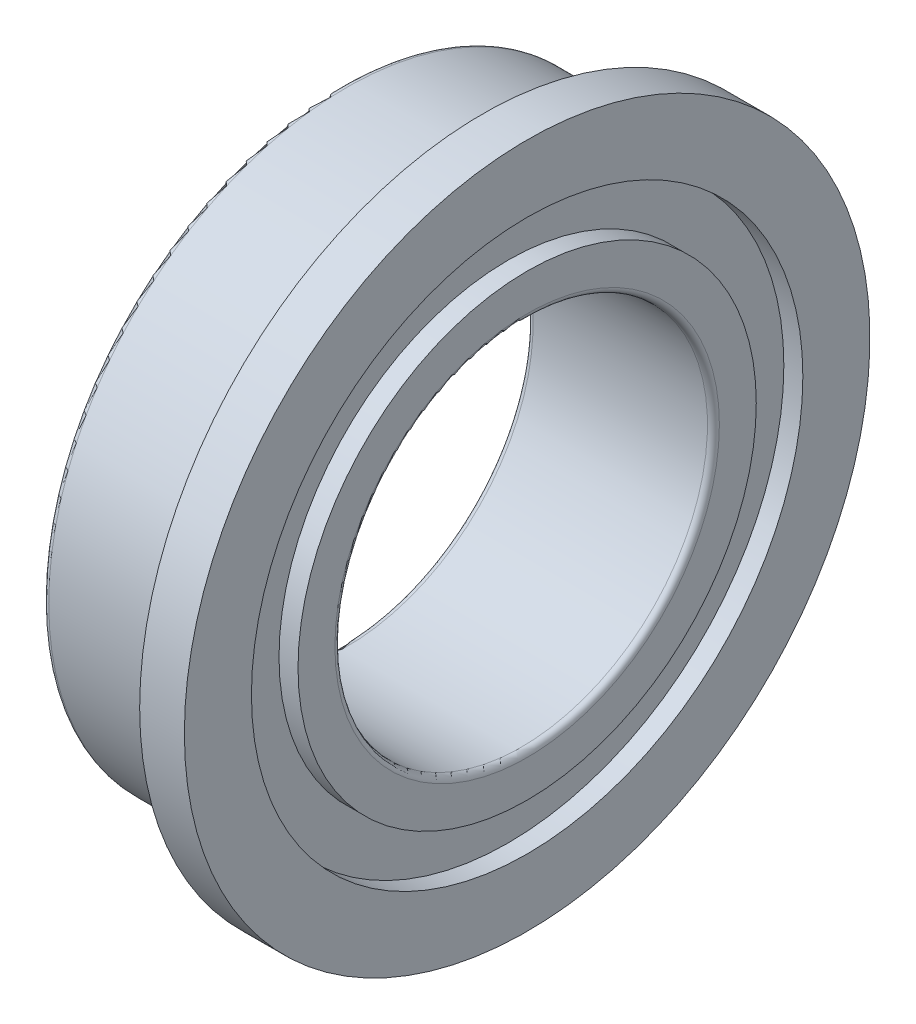
ISO-10303-21;
HEADER;
FILE_DESCRIPTION(('STEP AP214'),'2;1');
FILE_NAME('part.step','',(''),(''),'','','');
FILE_SCHEMA(('AUTOMOTIVE_DESIGN { 1 0 10303 214 1 1 1 1 }'));
ENDSEC;
DATA;
#1=APPLICATION_CONTEXT('core data for automotive mechanical design processes');
#2=APPLICATION_PROTOCOL_DEFINITION('international standard','automotive_design',2000,#1);
#3=PRODUCT_CONTEXT('',#1,'mechanical');
#4=PRODUCT('Part','Part','',(#3));
#5=PRODUCT_RELATED_PRODUCT_CATEGORY('part','',(#4));
#6=PRODUCT_DEFINITION_FORMATION('','',#4);
#7=PRODUCT_DEFINITION_CONTEXT('part definition',#1,'design');
#8=PRODUCT_DEFINITION('design','',#6,#7);
#9=PRODUCT_DEFINITION_SHAPE('','',#8);
#10=(LENGTH_UNIT() NAMED_UNIT(*) SI_UNIT(.MILLI.,.METRE.));
#11=(NAMED_UNIT(*) PLANE_ANGLE_UNIT() SI_UNIT($,.RADIAN.));
#12=(NAMED_UNIT(*) SI_UNIT($,.STERADIAN.) SOLID_ANGLE_UNIT());
#13=UNCERTAINTY_MEASURE_WITH_UNIT(LENGTH_MEASURE(1.E-05),#10,'distance_accuracy_value','');
#14=(GEOMETRIC_REPRESENTATION_CONTEXT(3) GLOBAL_UNCERTAINTY_ASSIGNED_CONTEXT((#13)) GLOBAL_UNIT_ASSIGNED_CONTEXT((#10,
#11,#12)) REPRESENTATION_CONTEXT('',''));
#15=CARTESIAN_POINT('',(0.,0.,0.));
#16=DIRECTION('',(0.,0.,1.));
#17=DIRECTION('',(1.,0.,0.));
#18=AXIS2_PLACEMENT_3D('',#15,#16,#17);
#19=CARTESIAN_POINT('',(0.,-3.075,-3.075));
#20=DIRECTION('',(-1.,0.,0.));
#21=DIRECTION('',(0.,0.,1.));
#22=AXIS2_PLACEMENT_3D('',#19,#20,#21);
#23=PLANE('',#22);
#24=CARTESIAN_POINT('',(0.,0.,0.));
#25=DIRECTION('',(-1.,0.,0.));
#26=DIRECTION('',(0.,0.,-1.));
#27=AXIS2_PLACEMENT_3D('',#24,#25,#26);
#28=CIRCLE('',#27,3.075);
#29=CARTESIAN_POINT('',(0.,0.,-3.075));
#30=VERTEX_POINT('',#29);
#31=EDGE_CURVE('E92',#30,#30,#28,.F.);
#32=ORIENTED_EDGE('',*,*,#31,.F.);
#33=EDGE_LOOP('',(#32));
#34=FACE_BOUND('',#33,.T.);
#35=CARTESIAN_POINT('',(0.,0.,0.));
#36=DIRECTION('',(1.,0.,0.));
#37=DIRECTION('',(0.,0.,1.));
#38=AXIS2_PLACEMENT_3D('',#35,#36,#37);
#39=CIRCLE('',#38,2.58000000000004);
#40=CARTESIAN_POINT('',(0.,0.,2.58000000000004));
#41=VERTEX_POINT('',#40);
#42=EDGE_CURVE('E88',#41,#41,#39,.T.);
#43=ORIENTED_EDGE('',*,*,#42,.T.);
#44=EDGE_LOOP('',(#43));
#45=FACE_BOUND('',#44,.T.);
#46=ADVANCED_FACE('F15',(#34,#45),#23,.T.);
#47=CARTESIAN_POINT('',(2.5,-3.075,3.075));
#48=DIRECTION('',(1.,0.,0.));
#49=DIRECTION('',(0.,0.,-1.));
#50=AXIS2_PLACEMENT_3D('',#47,#48,#49);
#51=PLANE('',#50);
#52=CARTESIAN_POINT('',(2.5,0.,0.));
#53=DIRECTION('',(1.,0.,0.));
#54=DIRECTION('',(0.,0.,1.));
#55=AXIS2_PLACEMENT_3D('',#52,#53,#54);
#56=CIRCLE('',#55,3.075);
#57=CARTESIAN_POINT('',(2.5,0.,3.075));
#58=VERTEX_POINT('',#57);
#59=EDGE_CURVE('E84',#58,#58,#56,.T.);
#60=ORIENTED_EDGE('',*,*,#59,.T.);
#61=EDGE_LOOP('',(#60));
#62=FACE_BOUND('',#61,.T.);
#63=CARTESIAN_POINT('',(2.5,0.,0.));
#64=DIRECTION('',(-1.,0.,0.));
#65=DIRECTION('',(0.,0.,-1.));
#66=AXIS2_PLACEMENT_3D('',#63,#64,#65);
#67=CIRCLE('',#66,2.58000001647513);
#68=CARTESIAN_POINT('',(2.5,0.,-2.58000001647513));
#69=VERTEX_POINT('',#68);
#70=EDGE_CURVE('E80',#69,#69,#67,.F.);
#71=ORIENTED_EDGE('',*,*,#70,.F.);
#72=EDGE_LOOP('',(#71));
#73=FACE_BOUND('',#72,.T.);
#74=ADVANCED_FACE('F101',(#62,#73),#51,.T.);
#75=CARTESIAN_POINT('',(2.245,-3.69999982086006,3.70000028383779));
#76=DIRECTION('',(1.,0.,0.));
#77=DIRECTION('',(0.,0.,-1.));
#78=AXIS2_PLACEMENT_3D('',#75,#76,#77);
#79=PLANE('',#78);
#80=CARTESIAN_POINT('',(2.245,0.,0.));
#81=DIRECTION('',(1.,0.,0.));
#82=DIRECTION('',(0.,-1.41945275113489E-07,0.99999999999999));
#83=AXIS2_PLACEMENT_3D('',#80,#81,#82);
#84=CIRCLE('',#83,3.7);
#85=CARTESIAN_POINT('',(2.245,-5.25197517919909E-07,3.69999999999996));
#86=VERTEX_POINT('',#85);
#87=EDGE_CURVE('E76',#86,#86,#84,.T.);
#88=ORIENTED_EDGE('',*,*,#87,.T.);
#89=EDGE_LOOP('',(#88));
#90=FACE_BOUND('',#89,.T.);
#91=CARTESIAN_POINT('',(2.245,0.,0.));
#92=DIRECTION('',(-1.,0.,0.));
#93=DIRECTION('',(0.,0.,-1.));
#94=AXIS2_PLACEMENT_3D('',#91,#92,#93);
#95=CIRCLE('',#94,3.075);
#96=CARTESIAN_POINT('',(2.245,0.,-3.075));
#97=VERTEX_POINT('',#96);
#98=EDGE_CURVE('E72',#97,#97,#95,.F.);
#99=ORIENTED_EDGE('',*,*,#98,.F.);
#100=EDGE_LOOP('',(#99));
#101=FACE_BOUND('',#100,.T.);
#102=ADVANCED_FACE('F172',(#90,#101),#79,.T.);
#103=CARTESIAN_POINT('',(2.5,-4.6,4.6));
#104=DIRECTION('',(1.,0.,0.));
#105=DIRECTION('',(0.,0.,-1.));
#106=AXIS2_PLACEMENT_3D('',#103,#104,#105);
#107=PLANE('',#106);
#108=CARTESIAN_POINT('',(2.5,0.,0.));
#109=DIRECTION('',(1.,0.,0.));
#110=DIRECTION('',(0.,0.,1.));
#111=AXIS2_PLACEMENT_3D('',#108,#109,#110);
#112=CIRCLE('',#111,4.6);
#113=CARTESIAN_POINT('',(2.5,0.,4.6));
#114=VERTEX_POINT('',#113);
#115=EDGE_CURVE('E68',#114,#114,#112,.T.);
#116=ORIENTED_EDGE('',*,*,#115,.T.);
#117=EDGE_LOOP('',(#116));
#118=FACE_BOUND('',#117,.T.);
#119=CARTESIAN_POINT('',(2.5,0.,0.));
#120=DIRECTION('',(-1.,0.,0.));
#121=DIRECTION('',(0.,0.,-1.));
#122=AXIS2_PLACEMENT_3D('',#119,#120,#121);
#123=CIRCLE('',#122,3.7);
#124=CARTESIAN_POINT('',(2.5,0.,-3.7));
#125=VERTEX_POINT('',#124);
#126=EDGE_CURVE('E64',#125,#125,#123,.F.);
#127=ORIENTED_EDGE('',*,*,#126,.F.);
#128=EDGE_LOOP('',(#127));
#129=FACE_BOUND('',#128,.T.);
#130=ADVANCED_FACE('F165',(#118,#129),#107,.T.);
#131=CARTESIAN_POINT('',(1.9,-4.6,-4.6));
#132=DIRECTION('',(-1.,0.,0.));
#133=DIRECTION('',(0.,0.,1.));
#134=AXIS2_PLACEMENT_3D('',#131,#132,#133);
#135=PLANE('',#134);
#136=CARTESIAN_POINT('',(1.9,0.,0.));
#137=DIRECTION('',(-1.,0.,0.));
#138=DIRECTION('',(0.,0.,-1.));
#139=AXIS2_PLACEMENT_3D('',#136,#137,#138);
#140=CIRCLE('',#139,4.6);
#141=CARTESIAN_POINT('',(1.9,0.,-4.6));
#142=VERTEX_POINT('',#141);
#143=EDGE_CURVE('E60',#142,#142,#140,.F.);
#144=ORIENTED_EDGE('',*,*,#143,.F.);
#145=EDGE_LOOP('',(#144));
#146=FACE_BOUND('',#145,.T.);
#147=CARTESIAN_POINT('',(1.9,0.,0.));
#148=DIRECTION('',(1.,0.,0.));
#149=DIRECTION('',(0.,-1.42353065283254E-07,0.99999999999999));
#150=AXIS2_PLACEMENT_3D('',#147,#148,#149);
#151=CIRCLE('',#150,4.07999999999999);
#152=CARTESIAN_POINT('',(1.9,-5.80800506355674E-07,4.07999999999994));
#153=VERTEX_POINT('',#152);
#154=EDGE_CURVE('E56',#153,#153,#151,.T.);
#155=ORIENTED_EDGE('',*,*,#154,.T.);
#156=EDGE_LOOP('',(#155));
#157=FACE_BOUND('',#156,.T.);
#158=ADVANCED_FACE('F160',(#146,#157),#135,.T.);
#159=CARTESIAN_POINT('',(0.,-3.92000000000003,-3.92000000000001));
#160=DIRECTION('',(-1.,0.,0.));
#161=DIRECTION('',(0.,0.,1.));
#162=AXIS2_PLACEMENT_3D('',#159,#160,#161);
#163=PLANE('',#162);
#164=CARTESIAN_POINT('',(0.,0.,0.));
#165=DIRECTION('',(-1.,0.,0.));
#166=DIRECTION('',(0.,0.,-1.));
#167=AXIS2_PLACEMENT_3D('',#164,#165,#166);
#168=CIRCLE('',#167,3.9200000088408);
#169=CARTESIAN_POINT('',(0.,0.,-3.9200000088408));
#170=VERTEX_POINT('',#169);
#171=EDGE_CURVE('E52',#170,#170,#168,.F.);
#172=ORIENTED_EDGE('',*,*,#171,.F.);
#173=EDGE_LOOP('',(#172));
#174=FACE_BOUND('',#173,.T.);
#175=CARTESIAN_POINT('',(0.,0.,0.));
#176=DIRECTION('',(1.,0.,0.));
#177=DIRECTION('',(0.,-1.4143312779194E-07,0.99999999999999));
#178=AXIS2_PLACEMENT_3D('',#175,#176,#177);
#179=CIRCLE('',#178,3.7);
#180=CARTESIAN_POINT('',(0.,-5.23302572830178E-07,3.69999999999996));
#181=VERTEX_POINT('',#180);
#182=EDGE_CURVE('E48',#181,#181,#179,.T.);
#183=ORIENTED_EDGE('',*,*,#182,.T.);
#184=EDGE_LOOP('',(#183));
#185=FACE_BOUND('',#184,.T.);
#186=ADVANCED_FACE('F119',(#174,#185),#163,.T.);
#187=CARTESIAN_POINT('',(0.255,-3.7,-3.7));
#188=DIRECTION('',(-1.,0.,0.));
#189=DIRECTION('',(0.,0.,1.));
#190=AXIS2_PLACEMENT_3D('',#187,#188,#189);
#191=PLANE('',#190);
#192=CARTESIAN_POINT('',(0.255,0.,0.));
#193=DIRECTION('',(-1.,0.,0.));
#194=DIRECTION('',(0.,0.,-1.));
#195=AXIS2_PLACEMENT_3D('',#192,#193,#194);
#196=CIRCLE('',#195,3.7);
#197=CARTESIAN_POINT('',(0.255,0.,-3.7));
#198=VERTEX_POINT('',#197);
#199=EDGE_CURVE('E44',#198,#198,#196,.F.);
#200=ORIENTED_EDGE('',*,*,#199,.F.);
#201=EDGE_LOOP('',(#200));
#202=FACE_BOUND('',#201,.T.);
#203=CARTESIAN_POINT('',(0.255,0.,0.));
#204=DIRECTION('',(1.,0.,0.));
#205=DIRECTION('',(0.,0.,1.));
#206=AXIS2_PLACEMENT_3D('',#203,#204,#205);
#207=CIRCLE('',#206,3.075);
#208=CARTESIAN_POINT('',(0.255,0.,3.075));
#209=VERTEX_POINT('',#208);
#210=EDGE_CURVE('E40',#209,#209,#207,.T.);
#211=ORIENTED_EDGE('',*,*,#210,.T.);
#212=EDGE_LOOP('',(#211));
#213=FACE_BOUND('',#212,.T.);
#214=ADVANCED_FACE('F108',(#202,#213),#191,.T.);
#215=CARTESIAN_POINT('',(0.0800000000000406,0.,0.));
#216=DIRECTION('',(1.,0.,0.));
#217=DIRECTION('',(0.,0.,1.));
#218=AXIS2_PLACEMENT_3D('',#215,#216,#217);
#219=TOROIDAL_SURFACE('',#218,2.58000000000004,0.0800000000000406);
#220=CARTESIAN_POINT('',(0.0799999999999999,0.,0.));
#221=DIRECTION('',(1.,0.,0.));
#222=DIRECTION('',(0.,0.,1.));
#223=AXIS2_PLACEMENT_3D('',#220,#221,#222);
#224=CIRCLE('',#223,2.5);
#225=CARTESIAN_POINT('',(0.0799999999999999,0.,2.5));
#226=VERTEX_POINT('',#225);
#227=EDGE_CURVE('E34',#226,#226,#224,.T.);
#228=ORIENTED_EDGE('',*,*,#227,.T.);
#229=EDGE_LOOP('',(#228));
#230=FACE_BOUND('',#229,.T.);
#231=ORIENTED_EDGE('',*,*,#42,.F.);
#232=EDGE_LOOP('',(#231));
#233=FACE_BOUND('',#232,.T.);
#234=ADVANCED_FACE('F105',(#230,#233),#219,.T.);
#235=CARTESIAN_POINT('',(8.,0.,0.));
#236=DIRECTION('',(1.,0.,0.));
#237=DIRECTION('',(0.,0.,1.));
#238=AXIS2_PLACEMENT_3D('',#235,#236,#237);
#239=CYLINDRICAL_SURFACE('',#238,2.5);
#240=CARTESIAN_POINT('',(2.42,0.,0.));
#241=DIRECTION('',(1.,0.,0.));
#242=DIRECTION('',(0.,0.,1.));
#243=AXIS2_PLACEMENT_3D('',#240,#241,#242);
#244=CIRCLE('',#243,2.5);
#245=CARTESIAN_POINT('',(2.42,0.,2.5));
#246=VERTEX_POINT('',#245);
#247=EDGE_CURVE('E29',#246,#246,#244,.T.);
#248=ORIENTED_EDGE('',*,*,#247,.T.);
#249=EDGE_LOOP('',(#248));
#250=FACE_BOUND('',#249,.T.);
#251=ORIENTED_EDGE('',*,*,#227,.F.);
#252=EDGE_LOOP('',(#251));
#253=FACE_BOUND('',#252,.T.);
#254=ADVANCED_FACE('F107',(#250,#253),#239,.F.);
#255=CARTESIAN_POINT('',(2.41999999999992,0.,0.));
#256=DIRECTION('',(1.,0.,0.));
#257=DIRECTION('',(0.,0.,1.));
#258=AXIS2_PLACEMENT_3D('',#255,#256,#257);
#259=TOROIDAL_SURFACE('',#258,2.58000000000008,0.0800000000000817);
#260=ORIENTED_EDGE('',*,*,#70,.T.);
#261=EDGE_LOOP('',(#260));
#262=FACE_BOUND('',#261,.T.);
#263=ORIENTED_EDGE('',*,*,#247,.F.);
#264=EDGE_LOOP('',(#263));
#265=FACE_BOUND('',#264,.T.);
#266=ADVANCED_FACE('F116',(#262,#265),#259,.T.);
#267=CARTESIAN_POINT('',(8.,0.,0.));
#268=DIRECTION('',(1.,0.,0.));
#269=DIRECTION('',(0.,0.,1.));
#270=AXIS2_PLACEMENT_3D('',#267,#268,#269);
#271=CYLINDRICAL_SURFACE('',#270,3.075);
#272=ORIENTED_EDGE('',*,*,#98,.T.);
#273=EDGE_LOOP('',(#272));
#274=FACE_BOUND('',#273,.T.);
#275=ORIENTED_EDGE('',*,*,#59,.F.);
#276=EDGE_LOOP('',(#275));
#277=FACE_BOUND('',#276,.T.);
#278=ADVANCED_FACE('F126',(#274,#277),#271,.T.);
#279=CARTESIAN_POINT('',(8.,0.,0.));
#280=DIRECTION('',(1.,0.,0.));
#281=DIRECTION('',(0.,0.,1.));
#282=AXIS2_PLACEMENT_3D('',#279,#280,#281);
#283=CYLINDRICAL_SURFACE('',#282,3.7);
#284=ORIENTED_EDGE('',*,*,#126,.T.);
#285=EDGE_LOOP('',(#284));
#286=FACE_BOUND('',#285,.T.);
#287=ORIENTED_EDGE('',*,*,#87,.F.);
#288=EDGE_LOOP('',(#287));
#289=FACE_BOUND('',#288,.T.);
#290=ADVANCED_FACE('F130',(#286,#289),#283,.F.);
#291=CARTESIAN_POINT('',(8.,0.,0.));
#292=DIRECTION('',(1.,0.,0.));
#293=DIRECTION('',(0.,0.,1.));
#294=AXIS2_PLACEMENT_3D('',#291,#292,#293);
#295=CYLINDRICAL_SURFACE('',#294,4.6);
#296=ORIENTED_EDGE('',*,*,#143,.T.);
#297=EDGE_LOOP('',(#296));
#298=FACE_BOUND('',#297,.T.);
#299=ORIENTED_EDGE('',*,*,#115,.F.);
#300=EDGE_LOOP('',(#299));
#301=FACE_BOUND('',#300,.T.);
#302=ADVANCED_FACE('F134',(#298,#301),#295,.T.);
#303=CARTESIAN_POINT('',(1.9,0.,0.));
#304=DIRECTION('',(1.,0.,0.));
#305=DIRECTION('',(0.,0.,1.));
#306=AXIS2_PLACEMENT_3D('',#303,#304,#305);
#307=TOROIDAL_SURFACE('',#306,4.,0.0799999999999855);
#308=ORIENTED_EDGE('',*,*,#154,.F.);
#309=EDGE_LOOP('',(#308));
#310=FACE_BOUND('',#309,.T.);
#311=CARTESIAN_POINT('',(1.82000000000001,0.,0.));
#312=DIRECTION('',(1.,0.,0.));
#313=DIRECTION('',(0.,0.,1.));
#314=AXIS2_PLACEMENT_3D('',#311,#312,#313);
#315=CIRCLE('',#314,4.);
#316=CARTESIAN_POINT('',(1.82000000000001,0.,4.));
#317=VERTEX_POINT('',#316);
#318=EDGE_CURVE('E23',#317,#317,#315,.T.);
#319=ORIENTED_EDGE('',*,*,#318,.T.);
#320=EDGE_LOOP('',(#319));
#321=FACE_BOUND('',#320,.T.);
#322=ADVANCED_FACE('F138',(#310,#321),#307,.F.);
#323=CARTESIAN_POINT('',(8.,0.,0.));
#324=DIRECTION('',(1.,0.,0.));
#325=DIRECTION('',(0.,0.,1.));
#326=AXIS2_PLACEMENT_3D('',#323,#324,#325);
#327=CYLINDRICAL_SURFACE('',#326,4.);
#328=CARTESIAN_POINT('',(0.0800000000000001,0.,0.));
#329=DIRECTION('',(1.,0.,0.));
#330=DIRECTION('',(0.,0.,1.));
#331=AXIS2_PLACEMENT_3D('',#328,#329,#330);
#332=CIRCLE('',#331,4.);
#333=CARTESIAN_POINT('',(0.0800000000000001,0.,4.));
#334=VERTEX_POINT('',#333);
#335=EDGE_CURVE('E10',#334,#334,#332,.T.);
#336=ORIENTED_EDGE('',*,*,#335,.T.);
#337=EDGE_LOOP('',(#336));
#338=FACE_BOUND('',#337,.T.);
#339=ORIENTED_EDGE('',*,*,#318,.F.);
#340=EDGE_LOOP('',(#339));
#341=FACE_BOUND('',#340,.T.);
#342=ADVANCED_FACE('F142',(#338,#341),#327,.T.);
#343=CARTESIAN_POINT('',(0.0800000000000401,0.,0.));
#344=DIRECTION('',(1.,0.,0.));
#345=DIRECTION('',(0.,1.42331188735307E-07,0.99999999999999));
#346=AXIS2_PLACEMENT_3D('',#343,#344,#345);
#347=TOROIDAL_SURFACE('',#346,3.92,0.080000000000041);
#348=ORIENTED_EDGE('',*,*,#171,.T.);
#349=EDGE_LOOP('',(#348));
#350=FACE_BOUND('',#349,.T.);
#351=ORIENTED_EDGE('',*,*,#335,.F.);
#352=EDGE_LOOP('',(#351));
#353=FACE_BOUND('',#352,.T.);
#354=ADVANCED_FACE('F146',(#350,#353),#347,.T.);
#355=CARTESIAN_POINT('',(8.,0.,0.));
#356=DIRECTION('',(1.,0.,0.));
#357=DIRECTION('',(0.,0.,1.));
#358=AXIS2_PLACEMENT_3D('',#355,#356,#357);
#359=CYLINDRICAL_SURFACE('',#358,3.7);
#360=ORIENTED_EDGE('',*,*,#199,.T.);
#361=EDGE_LOOP('',(#360));
#362=FACE_BOUND('',#361,.T.);
#363=ORIENTED_EDGE('',*,*,#182,.F.);
#364=EDGE_LOOP('',(#363));
#365=FACE_BOUND('',#364,.T.);
#366=ADVANCED_FACE('F148',(#362,#365),#359,.F.);
#367=CARTESIAN_POINT('',(8.,0.,0.));
#368=DIRECTION('',(1.,0.,0.));
#369=DIRECTION('',(0.,0.,1.));
#370=AXIS2_PLACEMENT_3D('',#367,#368,#369);
#371=CYLINDRICAL_SURFACE('',#370,3.075);
#372=ORIENTED_EDGE('',*,*,#31,.T.);
#373=EDGE_LOOP('',(#372));
#374=FACE_BOUND('',#373,.T.);
#375=ORIENTED_EDGE('',*,*,#210,.F.);
#376=EDGE_LOOP('',(#375));
#377=FACE_BOUND('',#376,.T.);
#378=ADVANCED_FACE('F17',(#374,#377),#371,.T.);
#379=CLOSED_SHELL('',(#46,#74,#102,#130,#158,#186,#214,#234,#254,#266,#278,#290,#302,#322,#342,
#354,#366,#378));
#380=MANIFOLD_SOLID_BREP('B1',#379);
#381=ADVANCED_BREP_SHAPE_REPRESENTATION('',(#18,#380),#14);
#382=SHAPE_DEFINITION_REPRESENTATION(#9,#381);
ENDSEC;
END-ISO-10303-21;
